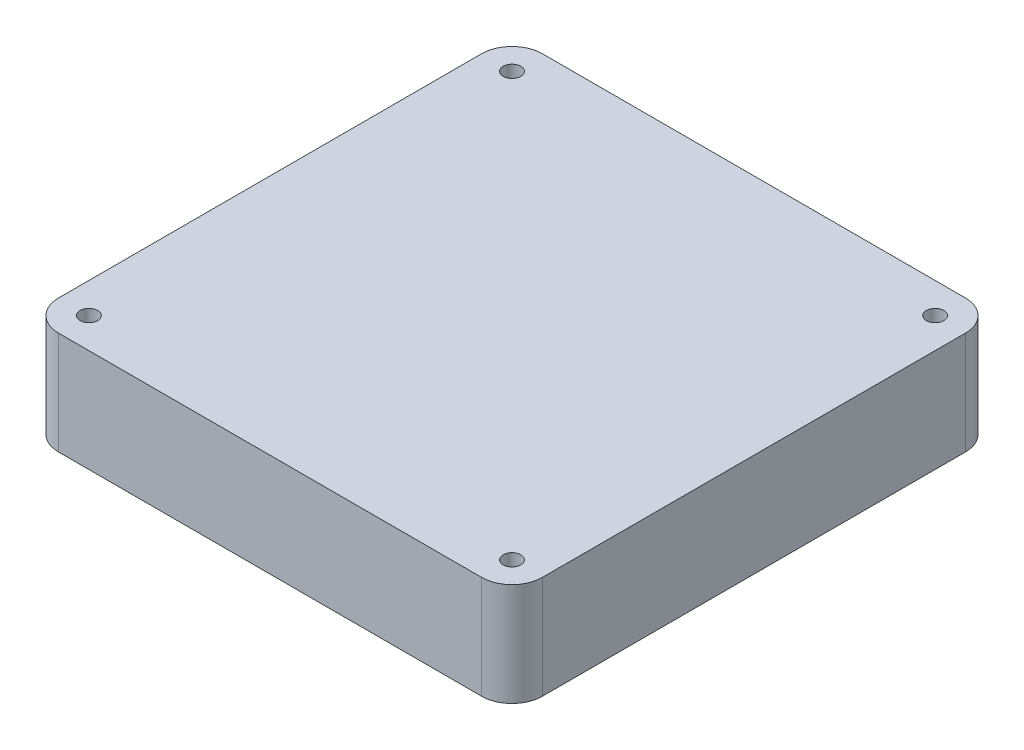
ISO-10303-21;
HEADER;
FILE_DESCRIPTION(('STEP AP214'),'2;1');
FILE_NAME('part.step','',(''),(''),'','','');
FILE_SCHEMA(('AUTOMOTIVE_DESIGN { 1 0 10303 214 1 1 1 1 }'));
ENDSEC;
DATA;
#1=APPLICATION_CONTEXT('core data for automotive mechanical design processes');
#2=APPLICATION_PROTOCOL_DEFINITION('international standard','automotive_design',2000,#1);
#3=PRODUCT_CONTEXT('',#1,'mechanical');
#4=PRODUCT('Part','Part','',(#3));
#5=PRODUCT_RELATED_PRODUCT_CATEGORY('part','',(#4));
#6=PRODUCT_DEFINITION_FORMATION('','',#4);
#7=PRODUCT_DEFINITION_CONTEXT('part definition',#1,'design');
#8=PRODUCT_DEFINITION('design','',#6,#7);
#9=PRODUCT_DEFINITION_SHAPE('','',#8);
#10=(LENGTH_UNIT() NAMED_UNIT(*) SI_UNIT(.MILLI.,.METRE.));
#11=(NAMED_UNIT(*) PLANE_ANGLE_UNIT() SI_UNIT($,.RADIAN.));
#12=(NAMED_UNIT(*) SI_UNIT($,.STERADIAN.) SOLID_ANGLE_UNIT());
#13=UNCERTAINTY_MEASURE_WITH_UNIT(LENGTH_MEASURE(1.E-05),#10,'distance_accuracy_value','');
#14=(GEOMETRIC_REPRESENTATION_CONTEXT(3) GLOBAL_UNCERTAINTY_ASSIGNED_CONTEXT((#13)) GLOBAL_UNIT_ASSIGNED_CONTEXT((#10,
#11,#12)) REPRESENTATION_CONTEXT('',''));
#15=CARTESIAN_POINT('',(0.,0.,0.));
#16=DIRECTION('',(0.,0.,1.));
#17=DIRECTION('',(1.,0.,0.));
#18=AXIS2_PLACEMENT_3D('',#15,#16,#17);
#19=CARTESIAN_POINT('',(-59.69,25.4,-59.69));
#20=DIRECTION('',(1.,0.,0.));
#21=DIRECTION('',(0.,0.,-1.));
#22=AXIS2_PLACEMENT_3D('',#19,#20,#21);
#23=PLANE('',#22);
#24=DIRECTION('',(0.,0.,1.));
#25=VECTOR('',#24,1.);
#26=CARTESIAN_POINT('',(-59.69,0.,-59.69));
#27=LINE('',#26,#25);
#28=CARTESIAN_POINT('',(-59.69,0.,-52.19));
#29=VERTEX_POINT('',#28);
#30=CARTESIAN_POINT('',(-59.69,0.,52.19));
#31=VERTEX_POINT('',#30);
#32=EDGE_CURVE('E113',#29,#31,#27,.T.);
#33=ORIENTED_EDGE('',*,*,#32,.T.);
#34=DIRECTION('',(0.,-1.,0.));
#35=VECTOR('',#34,1.);
#36=CARTESIAN_POINT('',(-59.69,25.4,52.19));
#37=LINE('',#36,#35);
#38=CARTESIAN_POINT('',(-59.69,25.4,52.19));
#39=VERTEX_POINT('',#38);
#40=EDGE_CURVE('E56',#31,#39,#37,.F.);
#41=ORIENTED_EDGE('',*,*,#40,.T.);
#42=DIRECTION('',(0.,0.,1.));
#43=VECTOR('',#42,1.);
#44=CARTESIAN_POINT('',(-59.69,25.4,-59.69));
#45=LINE('',#44,#43);
#46=CARTESIAN_POINT('',(-59.69,25.4,-52.19));
#47=VERTEX_POINT('',#46);
#48=EDGE_CURVE('E114',#47,#39,#45,.T.);
#49=ORIENTED_EDGE('',*,*,#48,.F.);
#50=DIRECTION('',(0.,-1.,0.));
#51=VECTOR('',#50,1.);
#52=CARTESIAN_POINT('',(-59.69,25.4,-52.19));
#53=LINE('',#52,#51);
#54=EDGE_CURVE('E106',#47,#29,#53,.T.);
#55=ORIENTED_EDGE('',*,*,#54,.T.);
#56=EDGE_LOOP('',(#33,#41,#49,#55));
#57=FACE_BOUND('',#56,.T.);
#58=ADVANCED_FACE('F33',(#57),#23,.F.);
#59=CARTESIAN_POINT('',(-59.69,25.4,59.69));
#60=DIRECTION('',(0.,0.,-1.));
#61=DIRECTION('',(-1.,0.,0.));
#62=AXIS2_PLACEMENT_3D('',#59,#60,#61);
#63=PLANE('',#62);
#64=DIRECTION('',(1.,0.,0.));
#65=VECTOR('',#64,1.);
#66=CARTESIAN_POINT('',(-59.69,25.4,59.69));
#67=LINE('',#66,#65);
#68=CARTESIAN_POINT('',(-52.19,25.4,59.69));
#69=VERTEX_POINT('',#68);
#70=CARTESIAN_POINT('',(52.19,25.4,59.69));
#71=VERTEX_POINT('',#70);
#72=EDGE_CURVE('E161',#69,#71,#67,.T.);
#73=ORIENTED_EDGE('',*,*,#72,.F.);
#74=DIRECTION('',(0.,-1.,0.));
#75=VECTOR('',#74,1.);
#76=CARTESIAN_POINT('',(-52.19,25.4,59.69));
#77=LINE('',#76,#75);
#78=CARTESIAN_POINT('',(-52.19,0.,59.69));
#79=VERTEX_POINT('',#78);
#80=EDGE_CURVE('E151',#69,#79,#77,.T.);
#81=ORIENTED_EDGE('',*,*,#80,.T.);
#82=DIRECTION('',(1.,0.,0.));
#83=VECTOR('',#82,1.);
#84=CARTESIAN_POINT('',(-59.69,0.,59.69));
#85=LINE('',#84,#83);
#86=CARTESIAN_POINT('',(52.19,0.,59.69));
#87=VERTEX_POINT('',#86);
#88=EDGE_CURVE('E120',#79,#87,#85,.T.);
#89=ORIENTED_EDGE('',*,*,#88,.T.);
#90=DIRECTION('',(0.,-1.,0.));
#91=VECTOR('',#90,1.);
#92=CARTESIAN_POINT('',(52.19,25.4,59.69));
#93=LINE('',#92,#91);
#94=EDGE_CURVE('E149',#87,#71,#93,.F.);
#95=ORIENTED_EDGE('',*,*,#94,.T.);
#96=EDGE_LOOP('',(#73,#81,#89,#95));
#97=FACE_BOUND('',#96,.T.);
#98=ADVANCED_FACE('F165',(#97),#63,.F.);
#99=CARTESIAN_POINT('',(59.69,25.4,-59.69));
#100=DIRECTION('',(-1.,0.,0.));
#101=DIRECTION('',(0.,0.,1.));
#102=AXIS2_PLACEMENT_3D('',#99,#100,#101);
#103=PLANE('',#102);
#104=DIRECTION('',(0.,0.,-1.));
#105=VECTOR('',#104,1.);
#106=CARTESIAN_POINT('',(59.69,25.4,-59.69));
#107=LINE('',#106,#105);
#108=CARTESIAN_POINT('',(59.69,25.4,52.19));
#109=VERTEX_POINT('',#108);
#110=CARTESIAN_POINT('',(59.69,25.4,-52.19));
#111=VERTEX_POINT('',#110);
#112=EDGE_CURVE('E167',#109,#111,#107,.T.);
#113=ORIENTED_EDGE('',*,*,#112,.F.);
#114=DIRECTION('',(0.,-1.,0.));
#115=VECTOR('',#114,1.);
#116=CARTESIAN_POINT('',(59.69,25.4,52.19));
#117=LINE('',#116,#115);
#118=CARTESIAN_POINT('',(59.69,0.,52.19));
#119=VERTEX_POINT('',#118);
#120=EDGE_CURVE('E11',#109,#119,#117,.T.);
#121=ORIENTED_EDGE('',*,*,#120,.T.);
#122=DIRECTION('',(0.,0.,-1.));
#123=VECTOR('',#122,1.);
#124=CARTESIAN_POINT('',(59.69,0.,-59.69));
#125=LINE('',#124,#123);
#126=CARTESIAN_POINT('',(59.69,0.,-52.19));
#127=VERTEX_POINT('',#126);
#128=EDGE_CURVE('E124',#119,#127,#125,.T.);
#129=ORIENTED_EDGE('',*,*,#128,.T.);
#130=DIRECTION('',(0.,-1.,0.));
#131=VECTOR('',#130,1.);
#132=CARTESIAN_POINT('',(59.69,25.4,-52.19));
#133=LINE('',#132,#131);
#134=EDGE_CURVE('E144',#127,#111,#133,.F.);
#135=ORIENTED_EDGE('',*,*,#134,.T.);
#136=EDGE_LOOP('',(#113,#121,#129,#135));
#137=FACE_BOUND('',#136,.T.);
#138=ADVANCED_FACE('F184',(#137),#103,.F.);
#139=CARTESIAN_POINT('',(-59.69,25.4,-59.69));
#140=DIRECTION('',(0.,0.,1.));
#141=DIRECTION('',(1.,0.,0.));
#142=AXIS2_PLACEMENT_3D('',#139,#140,#141);
#143=PLANE('',#142);
#144=DIRECTION('',(-1.,0.,0.));
#145=VECTOR('',#144,1.);
#146=CARTESIAN_POINT('',(-59.69,25.4,-59.69));
#147=LINE('',#146,#145);
#148=CARTESIAN_POINT('',(52.19,25.4,-59.69));
#149=VERTEX_POINT('',#148);
#150=CARTESIAN_POINT('',(-52.19,25.4,-59.69));
#151=VERTEX_POINT('',#150);
#152=EDGE_CURVE('E115',#149,#151,#147,.T.);
#153=ORIENTED_EDGE('',*,*,#152,.F.);
#154=DIRECTION('',(0.,-1.,0.));
#155=VECTOR('',#154,1.);
#156=CARTESIAN_POINT('',(52.19,25.4,-59.69));
#157=LINE('',#156,#155);
#158=CARTESIAN_POINT('',(52.19,0.,-59.69));
#159=VERTEX_POINT('',#158);
#160=EDGE_CURVE('E138',#149,#159,#157,.T.);
#161=ORIENTED_EDGE('',*,*,#160,.T.);
#162=DIRECTION('',(-1.,0.,0.));
#163=VECTOR('',#162,1.);
#164=CARTESIAN_POINT('',(-59.69,0.,-59.69));
#165=LINE('',#164,#163);
#166=CARTESIAN_POINT('',(-52.19,0.,-59.69));
#167=VERTEX_POINT('',#166);
#168=EDGE_CURVE('E133',#159,#167,#165,.T.);
#169=ORIENTED_EDGE('',*,*,#168,.T.);
#170=DIRECTION('',(0.,-1.,0.));
#171=VECTOR('',#170,1.);
#172=CARTESIAN_POINT('',(-52.19,25.4,-59.69));
#173=LINE('',#172,#171);
#174=EDGE_CURVE('E108',#167,#151,#173,.F.);
#175=ORIENTED_EDGE('',*,*,#174,.T.);
#176=EDGE_LOOP('',(#153,#161,#169,#175));
#177=FACE_BOUND('',#176,.T.);
#178=ADVANCED_FACE('F214',(#177),#143,.F.);
#179=CARTESIAN_POINT('',(0.,25.4,0.));
#180=DIRECTION('',(0.,1.,0.));
#181=DIRECTION('',(0.,0.,1.));
#182=AXIS2_PLACEMENT_3D('',#179,#180,#181);
#183=PLANE('',#182);
#184=CARTESIAN_POINT('',(52.19,25.4,-52.19));
#185=DIRECTION('',(0.,1.,0.));
#186=DIRECTION('',(0.,0.,1.));
#187=AXIS2_PLACEMENT_3D('',#184,#185,#186);
#188=CIRCLE('',#187,2.165);
#189=CARTESIAN_POINT('',(52.19,25.4,-50.025));
#190=VERTEX_POINT('',#189);
#191=EDGE_CURVE('E246',#190,#190,#188,.T.);
#192=ORIENTED_EDGE('',*,*,#191,.F.);
#193=EDGE_LOOP('',(#192));
#194=FACE_BOUND('',#193,.T.);
#195=CARTESIAN_POINT('',(52.19,25.4,52.19));
#196=DIRECTION('',(0.,1.,0.));
#197=DIRECTION('',(0.,0.,1.));
#198=AXIS2_PLACEMENT_3D('',#195,#196,#197);
#199=CIRCLE('',#198,2.165);
#200=CARTESIAN_POINT('',(52.19,25.4,54.355));
#201=VERTEX_POINT('',#200);
#202=EDGE_CURVE('E239',#201,#201,#199,.T.);
#203=ORIENTED_EDGE('',*,*,#202,.F.);
#204=EDGE_LOOP('',(#203));
#205=FACE_BOUND('',#204,.T.);
#206=CARTESIAN_POINT('',(-52.19,25.4,52.19));
#207=DIRECTION('',(0.,1.,0.));
#208=DIRECTION('',(0.,0.,1.));
#209=AXIS2_PLACEMENT_3D('',#206,#207,#208);
#210=CIRCLE('',#209,2.165);
#211=CARTESIAN_POINT('',(-52.19,25.4,54.355));
#212=VERTEX_POINT('',#211);
#213=EDGE_CURVE('E240',#212,#212,#210,.T.);
#214=ORIENTED_EDGE('',*,*,#213,.F.);
#215=EDGE_LOOP('',(#214));
#216=FACE_BOUND('',#215,.T.);
#217=CARTESIAN_POINT('',(-52.19,25.4,-52.19));
#218=DIRECTION('',(0.,1.,0.));
#219=DIRECTION('',(0.,0.,1.));
#220=AXIS2_PLACEMENT_3D('',#217,#218,#219);
#221=CIRCLE('',#220,2.165);
#222=CARTESIAN_POINT('',(-52.19,25.4,-50.025));
#223=VERTEX_POINT('',#222);
#224=EDGE_CURVE('E127',#223,#223,#221,.T.);
#225=ORIENTED_EDGE('',*,*,#224,.F.);
#226=EDGE_LOOP('',(#225));
#227=FACE_BOUND('',#226,.T.);
#228=ORIENTED_EDGE('',*,*,#48,.T.);
#229=CARTESIAN_POINT('',(-52.19,25.4,52.19));
#230=DIRECTION('',(0.,1.,0.));
#231=DIRECTION('',(0.,0.,1.));
#232=AXIS2_PLACEMENT_3D('',#229,#230,#231);
#233=CIRCLE('',#232,7.5);
#234=EDGE_CURVE('E41',#39,#69,#233,.T.);
#235=ORIENTED_EDGE('',*,*,#234,.T.);
#236=ORIENTED_EDGE('',*,*,#72,.T.);
#237=CARTESIAN_POINT('',(52.19,25.4,52.19));
#238=DIRECTION('',(0.,1.,0.));
#239=DIRECTION('',(0.,0.,1.));
#240=AXIS2_PLACEMENT_3D('',#237,#238,#239);
#241=CIRCLE('',#240,7.5);
#242=EDGE_CURVE('E48',#71,#109,#241,.T.);
#243=ORIENTED_EDGE('',*,*,#242,.T.);
#244=ORIENTED_EDGE('',*,*,#112,.T.);
#245=CARTESIAN_POINT('',(52.19,25.4,-52.19));
#246=DIRECTION('',(0.,1.,0.));
#247=DIRECTION('',(0.,0.,1.));
#248=AXIS2_PLACEMENT_3D('',#245,#246,#247);
#249=CIRCLE('',#248,7.5);
#250=EDGE_CURVE('E147',#111,#149,#249,.T.);
#251=ORIENTED_EDGE('',*,*,#250,.T.);
#252=ORIENTED_EDGE('',*,*,#152,.T.);
#253=CARTESIAN_POINT('',(-52.19,25.4,-52.19));
#254=DIRECTION('',(0.,1.,0.));
#255=DIRECTION('',(0.,0.,1.));
#256=AXIS2_PLACEMENT_3D('',#253,#254,#255);
#257=CIRCLE('',#256,7.5);
#258=EDGE_CURVE('E136',#151,#47,#257,.T.);
#259=ORIENTED_EDGE('',*,*,#258,.T.);
#260=EDGE_LOOP('',(#228,#235,#236,#243,#244,#251,#252,#259));
#261=FACE_BOUND('',#260,.T.);
#262=ADVANCED_FACE('F160',(#194,#205,#216,#227,#261),#183,.T.);
#263=CARTESIAN_POINT('',(0.,0.,0.));
#264=DIRECTION('',(0.,1.,0.));
#265=DIRECTION('',(0.,0.,1.));
#266=AXIS2_PLACEMENT_3D('',#263,#264,#265);
#267=PLANE('',#266);
#268=CARTESIAN_POINT('',(52.19,0.,-52.19));
#269=DIRECTION('',(0.,1.,0.));
#270=DIRECTION('',(0.,0.,1.));
#271=AXIS2_PLACEMENT_3D('',#268,#269,#270);
#272=CIRCLE('',#271,2.165);
#273=CARTESIAN_POINT('',(52.19,0.,-50.025));
#274=VERTEX_POINT('',#273);
#275=EDGE_CURVE('E235',#274,#274,#272,.F.);
#276=ORIENTED_EDGE('',*,*,#275,.F.);
#277=EDGE_LOOP('',(#276));
#278=FACE_BOUND('',#277,.T.);
#279=CARTESIAN_POINT('',(52.19,0.,52.19));
#280=DIRECTION('',(0.,1.,0.));
#281=DIRECTION('',(0.,0.,1.));
#282=AXIS2_PLACEMENT_3D('',#279,#280,#281);
#283=CIRCLE('',#282,2.165);
#284=CARTESIAN_POINT('',(52.19,0.,54.355));
#285=VERTEX_POINT('',#284);
#286=EDGE_CURVE('E243',#285,#285,#283,.F.);
#287=ORIENTED_EDGE('',*,*,#286,.F.);
#288=EDGE_LOOP('',(#287));
#289=FACE_BOUND('',#288,.T.);
#290=CARTESIAN_POINT('',(-52.19,0.,52.19));
#291=DIRECTION('',(0.,1.,0.));
#292=DIRECTION('',(0.,0.,1.));
#293=AXIS2_PLACEMENT_3D('',#290,#291,#292);
#294=CIRCLE('',#293,2.165);
#295=CARTESIAN_POINT('',(-52.19,0.,54.355));
#296=VERTEX_POINT('',#295);
#297=EDGE_CURVE('E236',#296,#296,#294,.F.);
#298=ORIENTED_EDGE('',*,*,#297,.F.);
#299=EDGE_LOOP('',(#298));
#300=FACE_BOUND('',#299,.T.);
#301=CARTESIAN_POINT('',(-52.19,0.,-52.19));
#302=DIRECTION('',(0.,1.,0.));
#303=DIRECTION('',(0.,0.,1.));
#304=AXIS2_PLACEMENT_3D('',#301,#302,#303);
#305=CIRCLE('',#304,2.165);
#306=CARTESIAN_POINT('',(-52.19,0.,-50.025));
#307=VERTEX_POINT('',#306);
#308=EDGE_CURVE('E121',#307,#307,#305,.F.);
#309=ORIENTED_EDGE('',*,*,#308,.F.);
#310=EDGE_LOOP('',(#309));
#311=FACE_BOUND('',#310,.T.);
#312=ORIENTED_EDGE('',*,*,#88,.F.);
#313=CARTESIAN_POINT('',(-52.19,0.,52.19));
#314=DIRECTION('',(0.,1.,0.));
#315=DIRECTION('',(0.,0.,1.));
#316=AXIS2_PLACEMENT_3D('',#313,#314,#315);
#317=CIRCLE('',#316,7.5);
#318=EDGE_CURVE('E119',#79,#31,#317,.F.);
#319=ORIENTED_EDGE('',*,*,#318,.T.);
#320=ORIENTED_EDGE('',*,*,#32,.F.);
#321=CARTESIAN_POINT('',(-52.19,0.,-52.19));
#322=DIRECTION('',(0.,1.,0.));
#323=DIRECTION('',(0.,0.,1.));
#324=AXIS2_PLACEMENT_3D('',#321,#322,#323);
#325=CIRCLE('',#324,7.5);
#326=EDGE_CURVE('E102',#29,#167,#325,.F.);
#327=ORIENTED_EDGE('',*,*,#326,.T.);
#328=ORIENTED_EDGE('',*,*,#168,.F.);
#329=CARTESIAN_POINT('',(52.19,0.,-52.19));
#330=DIRECTION('',(0.,1.,0.));
#331=DIRECTION('',(0.,0.,1.));
#332=AXIS2_PLACEMENT_3D('',#329,#330,#331);
#333=CIRCLE('',#332,7.5);
#334=EDGE_CURVE('E141',#159,#127,#333,.F.);
#335=ORIENTED_EDGE('',*,*,#334,.T.);
#336=ORIENTED_EDGE('',*,*,#128,.F.);
#337=CARTESIAN_POINT('',(52.19,0.,52.19));
#338=DIRECTION('',(0.,1.,0.));
#339=DIRECTION('',(0.,0.,1.));
#340=AXIS2_PLACEMENT_3D('',#337,#338,#339);
#341=CIRCLE('',#340,7.5);
#342=EDGE_CURVE('E154',#119,#87,#341,.F.);
#343=ORIENTED_EDGE('',*,*,#342,.T.);
#344=EDGE_LOOP('',(#312,#319,#320,#327,#328,#335,#336,#343));
#345=FACE_BOUND('',#344,.T.);
#346=ADVANCED_FACE('F118',(#278,#289,#300,#311,#345),#267,.F.);
#347=CARTESIAN_POINT('',(-52.19,-0.001000000000001,-52.19));
#348=DIRECTION('',(0.,1.,0.));
#349=DIRECTION('',(0.,0.,1.));
#350=AXIS2_PLACEMENT_3D('',#347,#348,#349);
#351=CYLINDRICAL_SURFACE('',#350,2.165);
#352=ORIENTED_EDGE('',*,*,#224,.T.);
#353=EDGE_LOOP('',(#352));
#354=FACE_BOUND('',#353,.T.);
#355=ORIENTED_EDGE('',*,*,#308,.T.);
#356=EDGE_LOOP('',(#355));
#357=FACE_BOUND('',#356,.T.);
#358=ADVANCED_FACE('F207',(#354,#357),#351,.F.);
#359=CARTESIAN_POINT('',(-52.19,-0.001000000000001,52.19));
#360=DIRECTION('',(0.,1.,0.));
#361=DIRECTION('',(0.,0.,1.));
#362=AXIS2_PLACEMENT_3D('',#359,#360,#361);
#363=CYLINDRICAL_SURFACE('',#362,2.165);
#364=ORIENTED_EDGE('',*,*,#213,.T.);
#365=EDGE_LOOP('',(#364));
#366=FACE_BOUND('',#365,.T.);
#367=ORIENTED_EDGE('',*,*,#297,.T.);
#368=EDGE_LOOP('',(#367));
#369=FACE_BOUND('',#368,.T.);
#370=ADVANCED_FACE('F199',(#366,#369),#363,.F.);
#371=CARTESIAN_POINT('',(52.19,-0.001000000000001,52.19));
#372=DIRECTION('',(0.,1.,0.));
#373=DIRECTION('',(0.,0.,1.));
#374=AXIS2_PLACEMENT_3D('',#371,#372,#373);
#375=CYLINDRICAL_SURFACE('',#374,2.165);
#376=ORIENTED_EDGE('',*,*,#202,.T.);
#377=EDGE_LOOP('',(#376));
#378=FACE_BOUND('',#377,.T.);
#379=ORIENTED_EDGE('',*,*,#286,.T.);
#380=EDGE_LOOP('',(#379));
#381=FACE_BOUND('',#380,.T.);
#382=ADVANCED_FACE('F193',(#378,#381),#375,.F.);
#383=CARTESIAN_POINT('',(52.19,-0.001000000000001,-52.19));
#384=DIRECTION('',(0.,1.,0.));
#385=DIRECTION('',(0.,0.,1.));
#386=AXIS2_PLACEMENT_3D('',#383,#384,#385);
#387=CYLINDRICAL_SURFACE('',#386,2.165);
#388=ORIENTED_EDGE('',*,*,#191,.T.);
#389=EDGE_LOOP('',(#388));
#390=FACE_BOUND('',#389,.T.);
#391=ORIENTED_EDGE('',*,*,#275,.T.);
#392=EDGE_LOOP('',(#391));
#393=FACE_BOUND('',#392,.T.);
#394=ADVANCED_FACE('F189',(#390,#393),#387,.F.);
#395=CARTESIAN_POINT('',(-52.19,25.4,-52.19));
#396=DIRECTION('',(0.,-1.,0.));
#397=DIRECTION('',(0.,0.,-1.));
#398=AXIS2_PLACEMENT_3D('',#395,#396,#397);
#399=CYLINDRICAL_SURFACE('',#398,7.5);
#400=ORIENTED_EDGE('',*,*,#258,.F.);
#401=ORIENTED_EDGE('',*,*,#174,.F.);
#402=ORIENTED_EDGE('',*,*,#326,.F.);
#403=ORIENTED_EDGE('',*,*,#54,.F.);
#404=EDGE_LOOP('',(#400,#401,#402,#403));
#405=FACE_BOUND('',#404,.T.);
#406=ADVANCED_FACE('F105',(#405),#399,.T.);
#407=CARTESIAN_POINT('',(52.19,25.4,-52.19));
#408=DIRECTION('',(0.,-1.,0.));
#409=DIRECTION('',(0.,0.,-1.));
#410=AXIS2_PLACEMENT_3D('',#407,#408,#409);
#411=CYLINDRICAL_SURFACE('',#410,7.5);
#412=ORIENTED_EDGE('',*,*,#250,.F.);
#413=ORIENTED_EDGE('',*,*,#134,.F.);
#414=ORIENTED_EDGE('',*,*,#334,.F.);
#415=ORIENTED_EDGE('',*,*,#160,.F.);
#416=EDGE_LOOP('',(#412,#413,#414,#415));
#417=FACE_BOUND('',#416,.T.);
#418=ADVANCED_FACE('F171',(#417),#411,.T.);
#419=CARTESIAN_POINT('',(-52.19,25.4,52.19));
#420=DIRECTION('',(0.,-1.,0.));
#421=DIRECTION('',(0.,0.,-1.));
#422=AXIS2_PLACEMENT_3D('',#419,#420,#421);
#423=CYLINDRICAL_SURFACE('',#422,7.5);
#424=ORIENTED_EDGE('',*,*,#234,.F.);
#425=ORIENTED_EDGE('',*,*,#40,.F.);
#426=ORIENTED_EDGE('',*,*,#318,.F.);
#427=ORIENTED_EDGE('',*,*,#80,.F.);
#428=EDGE_LOOP('',(#424,#425,#426,#427));
#429=FACE_BOUND('',#428,.T.);
#430=ADVANCED_FACE('F169',(#429),#423,.T.);
#431=CARTESIAN_POINT('',(52.19,25.4,52.19));
#432=DIRECTION('',(0.,-1.,0.));
#433=DIRECTION('',(0.,0.,-1.));
#434=AXIS2_PLACEMENT_3D('',#431,#432,#433);
#435=CYLINDRICAL_SURFACE('',#434,7.5);
#436=ORIENTED_EDGE('',*,*,#242,.F.);
#437=ORIENTED_EDGE('',*,*,#94,.F.);
#438=ORIENTED_EDGE('',*,*,#342,.F.);
#439=ORIENTED_EDGE('',*,*,#120,.F.);
#440=EDGE_LOOP('',(#436,#437,#438,#439));
#441=FACE_BOUND('',#440,.T.);
#442=ADVANCED_FACE('F35',(#441),#435,.T.);
#443=CLOSED_SHELL('',(#58,#98,#138,#178,#262,#346,#358,#370,#382,#394,#406,#418,#430,#442));
#444=MANIFOLD_SOLID_BREP('B2',#443);
#445=ADVANCED_BREP_SHAPE_REPRESENTATION('',(#18,#444),#14);
#446=SHAPE_DEFINITION_REPRESENTATION(#9,#445);
ENDSEC;
END-ISO-10303-21;
